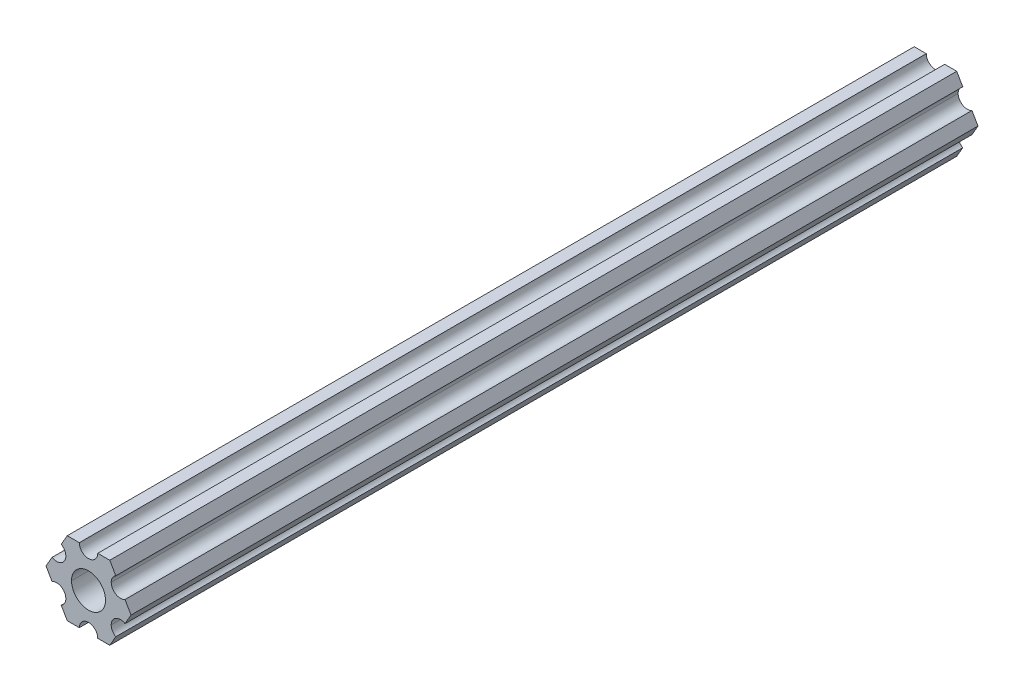
ISO-10303-21;
HEADER;
FILE_DESCRIPTION(('STEP AP214'),'2;1');
FILE_NAME('part.step','',(''),(''),'','','');
FILE_SCHEMA(('AUTOMOTIVE_DESIGN { 1 0 10303 214 1 1 1 1 }'));
ENDSEC;
DATA;
#1=APPLICATION_CONTEXT('core data for automotive mechanical design processes');
#2=APPLICATION_PROTOCOL_DEFINITION('international standard','automotive_design',2000,#1);
#3=PRODUCT_CONTEXT('',#1,'mechanical');
#4=PRODUCT('Part','Part','',(#3));
#5=PRODUCT_RELATED_PRODUCT_CATEGORY('part','',(#4));
#6=PRODUCT_DEFINITION_FORMATION('','',#4);
#7=PRODUCT_DEFINITION_CONTEXT('part definition',#1,'design');
#8=PRODUCT_DEFINITION('design','',#6,#7);
#9=PRODUCT_DEFINITION_SHAPE('','',#8);
#10=(LENGTH_UNIT() NAMED_UNIT(*) SI_UNIT(.MILLI.,.METRE.));
#11=(NAMED_UNIT(*) PLANE_ANGLE_UNIT() SI_UNIT($,.RADIAN.));
#12=(NAMED_UNIT(*) SI_UNIT($,.STERADIAN.) SOLID_ANGLE_UNIT());
#13=UNCERTAINTY_MEASURE_WITH_UNIT(LENGTH_MEASURE(1.E-05),#10,'distance_accuracy_value','');
#14=(GEOMETRIC_REPRESENTATION_CONTEXT(3) GLOBAL_UNCERTAINTY_ASSIGNED_CONTEXT((#13)) GLOBAL_UNIT_ASSIGNED_CONTEXT((#10,
#11,#12)) REPRESENTATION_CONTEXT('',''));
#15=CARTESIAN_POINT('',(0.,0.,0.));
#16=DIRECTION('',(0.,0.,1.));
#17=DIRECTION('',(1.,0.,0.));
#18=AXIS2_PLACEMENT_3D('',#15,#16,#17);
#19=CARTESIAN_POINT('',(0.,0.,304.8));
#20=DIRECTION('',(0.,0.,-1.));
#21=DIRECTION('',(-1.,0.,0.));
#22=AXIS2_PLACEMENT_3D('',#19,#20,#21);
#23=CYLINDRICAL_SURFACE('',#22,2.9337);
#24=DIRECTION('',(0.,0.,-1.));
#25=VECTOR('',#24,1.);
#26=CARTESIAN_POINT('',(2.9337,0.,304.8));
#27=LINE('',#26,#25);
#28=CARTESIAN_POINT('',(2.9337,0.,304.8));
#29=VERTEX_POINT('',#28);
#30=CARTESIAN_POINT('',(2.9337,0.,158.75));
#31=VERTEX_POINT('',#30);
#32=EDGE_CURVE('E250',#29,#31,#27,.T.);
#33=ORIENTED_EDGE('',*,*,#32,.T.);
#34=CARTESIAN_POINT('',(0.,0.,158.75));
#35=DIRECTION('',(0.,0.,1.));
#36=DIRECTION('',(1.,0.,0.));
#37=AXIS2_PLACEMENT_3D('',#34,#35,#36);
#38=CIRCLE('',#37,2.9337);
#39=CARTESIAN_POINT('',(-2.9337,0.,158.75));
#40=VERTEX_POINT('',#39);
#41=EDGE_CURVE('E66',#31,#40,#38,.F.);
#42=ORIENTED_EDGE('',*,*,#41,.T.);
#43=DIRECTION('',(0.,0.,-1.));
#44=VECTOR('',#43,1.);
#45=CARTESIAN_POINT('',(-2.9337,0.,304.8));
#46=LINE('',#45,#44);
#47=CARTESIAN_POINT('',(-2.9337,0.,304.8));
#48=VERTEX_POINT('',#47);
#49=EDGE_CURVE('E400',#48,#40,#46,.T.);
#50=ORIENTED_EDGE('',*,*,#49,.F.);
#51=CARTESIAN_POINT('',(0.,0.,304.8));
#52=DIRECTION('',(0.,0.,1.));
#53=DIRECTION('',(1.,0.,0.));
#54=AXIS2_PLACEMENT_3D('',#51,#52,#53);
#55=CIRCLE('',#54,2.9337);
#56=EDGE_CURVE('E52',#48,#29,#55,.T.);
#57=ORIENTED_EDGE('',*,*,#56,.T.);
#58=EDGE_LOOP('',(#33,#42,#50,#57));
#59=FACE_BOUND('',#58,.T.);
#60=ADVANCED_FACE('F44',(#59),#23,.F.);
#61=CARTESIAN_POINT('',(5.49926150638082,-3.17499966684067,304.8));
#62=DIRECTION('',(0.,0.,-1.));
#63=DIRECTION('',(-1.,0.,0.));
#64=AXIS2_PLACEMENT_3D('',#61,#62,#63);
#65=CYLINDRICAL_SURFACE('',#64,1.5875);
#66=DIRECTION('',(0.,0.,-1.));
#67=VECTOR('',#66,1.);
#68=CARTESIAN_POINT('',(3.91176150638082,-3.17499966684067,304.8));
#69=LINE('',#68,#67);
#70=CARTESIAN_POINT('',(3.91176150638082,-3.17499966684067,304.8));
#71=VERTEX_POINT('',#70);
#72=CARTESIAN_POINT('',(3.91176150638082,-3.17499966684067,158.75));
#73=VERTEX_POINT('',#72);
#74=EDGE_CURVE('E253',#71,#73,#69,.T.);
#75=ORIENTED_EDGE('',*,*,#74,.T.);
#76=CARTESIAN_POINT('',(5.49926150638082,-3.17499966684067,158.75));
#77=DIRECTION('',(0.,0.,1.));
#78=DIRECTION('',(1.,0.,0.));
#79=AXIS2_PLACEMENT_3D('',#76,#77,#78);
#80=CIRCLE('',#79,1.5875);
#81=CARTESIAN_POINT('',(6.29301142309098,-1.80018429024546,158.75));
#82=VERTEX_POINT('',#81);
#83=EDGE_CURVE('E59',#73,#82,#80,.F.);
#84=ORIENTED_EDGE('',*,*,#83,.T.);
#85=DIRECTION('',(0.,0.,-1.));
#86=VECTOR('',#85,1.);
#87=CARTESIAN_POINT('',(6.29301142309098,-1.80018429024546,304.8));
#88=LINE('',#87,#86);
#89=CARTESIAN_POINT('',(6.29301142309098,-1.80018429024546,304.8));
#90=VERTEX_POINT('',#89);
#91=EDGE_CURVE('E289',#90,#82,#88,.T.);
#92=ORIENTED_EDGE('',*,*,#91,.F.);
#93=CARTESIAN_POINT('',(5.49926150638082,-3.17499966684067,304.8));
#94=DIRECTION('',(0.,0.,-1.));
#95=DIRECTION('',(1.,0.,0.));
#96=AXIS2_PLACEMENT_3D('',#93,#94,#95);
#97=CIRCLE('',#96,1.5875);
#98=EDGE_CURVE('E276',#71,#90,#97,.T.);
#99=ORIENTED_EDGE('',*,*,#98,.F.);
#100=EDGE_LOOP('',(#75,#84,#92,#99));
#101=FACE_BOUND('',#100,.T.);
#102=ADVANCED_FACE('F492',(#101),#65,.F.);
#103=CARTESIAN_POINT('',(5.49926112168156,3.17500033315934,304.8));
#104=DIRECTION('',(0.,0.,-1.));
#105=DIRECTION('',(-1.,0.,0.));
#106=AXIS2_PLACEMENT_3D('',#103,#104,#105);
#107=CYLINDRICAL_SURFACE('',#106,1.5875);
#108=DIRECTION('',(0.,0.,-1.));
#109=VECTOR('',#108,1.);
#110=CARTESIAN_POINT('',(3.91176112168156,3.17500033315934,304.8));
#111=LINE('',#110,#109);
#112=CARTESIAN_POINT('',(3.91176112168156,3.17500033315934,304.8));
#113=VERTEX_POINT('',#112);
#114=CARTESIAN_POINT('',(3.91176112168156,3.17500033315934,158.75));
#115=VERTEX_POINT('',#114);
#116=EDGE_CURVE('E340',#113,#115,#111,.T.);
#117=ORIENTED_EDGE('',*,*,#116,.T.);
#118=CARTESIAN_POINT('',(5.49926112168156,3.17500033315934,158.75));
#119=DIRECTION('',(0.,0.,1.));
#120=DIRECTION('',(1.,0.,0.));
#121=AXIS2_PLACEMENT_3D('',#118,#119,#120);
#122=CIRCLE('',#121,1.5875);
#123=CARTESIAN_POINT('',(4.70551103839172,4.54981561357972,158.75));
#124=VERTEX_POINT('',#123);
#125=EDGE_CURVE('E452',#115,#124,#122,.F.);
#126=ORIENTED_EDGE('',*,*,#125,.T.);
#127=DIRECTION('',(0.,0.,-1.));
#128=VECTOR('',#127,1.);
#129=CARTESIAN_POINT('',(4.70551103839172,4.54981561357972,304.8));
#130=LINE('',#129,#128);
#131=CARTESIAN_POINT('',(4.70551103839172,4.54981561357972,304.8));
#132=VERTEX_POINT('',#131);
#133=EDGE_CURVE('E271',#132,#124,#130,.T.);
#134=ORIENTED_EDGE('',*,*,#133,.F.);
#135=CARTESIAN_POINT('',(5.49926112168156,3.17500033315934,304.8));
#136=DIRECTION('',(0.,0.,-1.));
#137=DIRECTION('',(1.,0.,0.));
#138=AXIS2_PLACEMENT_3D('',#135,#136,#137);
#139=CIRCLE('',#138,1.5875);
#140=EDGE_CURVE('E295',#113,#132,#139,.T.);
#141=ORIENTED_EDGE('',*,*,#140,.F.);
#142=EDGE_LOOP('',(#117,#126,#134,#141));
#143=FACE_BOUND('',#142,.T.);
#144=ADVANCED_FACE('F486',(#143),#107,.F.);
#145=CARTESIAN_POINT('',(5.49926112168156,3.17500033315934,304.8));
#146=DIRECTION('',(0.,0.,1.));
#147=DIRECTION('',(1.,0.,0.));
#148=AXIS2_PLACEMENT_3D('',#145,#146,#147);
#149=PLANE('',#148);
#150=DIRECTION('',(0.499999947533953,0.866025434075723,0.));
#151=VECTOR('',#150,1.);
#152=CARTESIAN_POINT('',(6.29301142309098,-1.80018429024546,304.8));
#153=LINE('',#152,#151);
#154=CARTESIAN_POINT('',(7.33234841870827,4.44212519169686E-07,304.8));
#155=VERTEX_POINT('',#154);
#156=EDGE_CURVE('E348',#90,#155,#153,.T.);
#157=ORIENTED_EDGE('',*,*,#156,.T.);
#158=DIRECTION('',(-0.500000052466056,0.866025373493145,0.));
#159=VECTOR('',#158,1.);
#160=CARTESIAN_POINT('',(7.33234841870827,4.44212519169686E-07,304.8));
#161=LINE('',#160,#159);
#162=CARTESIAN_POINT('',(6.29301120497139,1.80018505273894,304.8));
#163=VERTEX_POINT('',#162);
#164=EDGE_CURVE('E294',#155,#163,#161,.T.);
#165=ORIENTED_EDGE('',*,*,#164,.T.);
#166=CARTESIAN_POINT('',(5.49926112168156,3.17500033315934,304.8));
#167=DIRECTION('',(0.,0.,-1.));
#168=DIRECTION('',(1.,0.,0.));
#169=AXIS2_PLACEMENT_3D('',#166,#167,#168);
#170=CIRCLE('',#169,1.5875);
#171=EDGE_CURVE('E290',#163,#113,#170,.T.);
#172=ORIENTED_EDGE('',*,*,#171,.T.);
#173=ORIENTED_EDGE('',*,*,#140,.T.);
#174=DIRECTION('',(-0.500000052466046,0.866025373493151,0.));
#175=VECTOR('',#174,1.);
#176=CARTESIAN_POINT('',(4.70551103839172,4.54981561357972,304.8));
#177=LINE('',#176,#175);
#178=CARTESIAN_POINT('',(3.66617382465481,6.35000022210627,304.8));
#179=VERTEX_POINT('',#178);
#180=EDGE_CURVE('E355',#132,#179,#177,.T.);
#181=ORIENTED_EDGE('',*,*,#180,.T.);
#182=DIRECTION('',(-1.,-6.05825850611185E-08,0.));
#183=VECTOR('',#182,1.);
#184=CARTESIAN_POINT('',(3.66617382465481,6.35000022210627,304.8));
#185=LINE('',#184,#183);
#186=CARTESIAN_POINT('',(1.58749961530074,6.35000009617482,304.8));
#187=VERTEX_POINT('',#186);
#188=EDGE_CURVE('E361',#179,#187,#185,.T.);
#189=ORIENTED_EDGE('',*,*,#188,.T.);
#190=CARTESIAN_POINT('',(-3.84699260060323E-07,6.35,304.8));
#191=DIRECTION('',(0.,0.,-1.));
#192=DIRECTION('',(1.,0.,0.));
#193=AXIS2_PLACEMENT_3D('',#190,#191,#192);
#194=CIRCLE('',#193,1.5875);
#195=CARTESIAN_POINT('',(-1.58750038469926,6.34999990382519,304.8));
#196=VERTEX_POINT('',#195);
#197=EDGE_CURVE('E369',#187,#196,#194,.T.);
#198=ORIENTED_EDGE('',*,*,#197,.T.);
#199=DIRECTION('',(-1.,-6.05825963273174E-08,0.));
#200=VECTOR('',#199,1.);
#201=CARTESIAN_POINT('',(-1.58750038469926,6.34999990382518,304.8));
#202=LINE('',#201,#200);
#203=CARTESIAN_POINT('',(-3.66617459405349,6.3499997778937,304.8));
#204=VERTEX_POINT('',#203);
#205=EDGE_CURVE('E381',#196,#204,#202,.T.);
#206=ORIENTED_EDGE('',*,*,#205,.T.);
#207=DIRECTION('',(-0.499999947533943,-0.866025434075729,0.));
#208=VECTOR('',#207,1.);
#209=CARTESIAN_POINT('',(-3.66617459405349,6.3499997778937,304.8));
#210=LINE('',#209,#208);
#211=CARTESIAN_POINT('',(-4.70551158967065,4.54981504343587,304.8));
#212=VERTEX_POINT('',#211);
#213=EDGE_CURVE('E235',#204,#212,#210,.T.);
#214=ORIENTED_EDGE('',*,*,#213,.T.);
#215=CARTESIAN_POINT('',(-5.49926150638082,3.17499966684067,304.8));
#216=DIRECTION('',(0.,0.,-1.));
#217=DIRECTION('',(1.,0.,0.));
#218=AXIS2_PLACEMENT_3D('',#215,#216,#217);
#219=CIRCLE('',#218,1.5875);
#220=CARTESIAN_POINT('',(-6.29301142309098,1.80018429024547,304.8));
#221=VERTEX_POINT('',#220);
#222=EDGE_CURVE('E264',#212,#221,#219,.T.);
#223=ORIENTED_EDGE('',*,*,#222,.T.);
#224=DIRECTION('',(-0.499999947533951,-0.866025434075724,0.));
#225=VECTOR('',#224,1.);
#226=CARTESIAN_POINT('',(-6.29301142309098,1.80018429024547,304.8));
#227=LINE('',#226,#225);
#228=CARTESIAN_POINT('',(-7.33234841870827,-4.44212523790841E-07,304.8));
#229=VERTEX_POINT('',#228);
#230=EDGE_CURVE('E260',#221,#229,#227,.T.);
#231=ORIENTED_EDGE('',*,*,#230,.T.);
#232=DIRECTION('',(0.500000052466045,-0.866025373493151,0.));
#233=VECTOR('',#232,1.);
#234=CARTESIAN_POINT('',(-7.33234841870827,-4.44212523790841E-07,304.8));
#235=LINE('',#234,#233);
#236=CARTESIAN_POINT('',(-6.29301120497141,-1.80018505273897,304.8));
#237=VERTEX_POINT('',#236);
#238=EDGE_CURVE('E265',#229,#237,#235,.T.);
#239=ORIENTED_EDGE('',*,*,#238,.T.);
#240=CARTESIAN_POINT('',(-5.49926112168156,-3.17500033315934,304.8));
#241=DIRECTION('',(0.,0.,-1.));
#242=DIRECTION('',(1.,0.,0.));
#243=AXIS2_PLACEMENT_3D('',#240,#241,#242);
#244=CIRCLE('',#243,1.5875);
#245=CARTESIAN_POINT('',(-4.70551103839172,-4.54981561357972,304.8));
#246=VERTEX_POINT('',#245);
#247=EDGE_CURVE('E280',#237,#246,#244,.T.);
#248=ORIENTED_EDGE('',*,*,#247,.T.);
#249=DIRECTION('',(0.500000052466045,-0.866025373493152,0.));
#250=VECTOR('',#249,1.);
#251=CARTESIAN_POINT('',(-4.70551103839172,-4.54981561357972,304.8));
#252=LINE('',#251,#250);
#253=CARTESIAN_POINT('',(-3.66617382465481,-6.35000022210628,304.8));
#254=VERTEX_POINT('',#253);
#255=EDGE_CURVE('E336',#246,#254,#252,.T.);
#256=ORIENTED_EDGE('',*,*,#255,.T.);
#257=DIRECTION('',(1.,6.05825854783851E-08,0.));
#258=VECTOR('',#257,1.);
#259=CARTESIAN_POINT('',(-3.66617382465481,-6.35000022210628,304.8));
#260=LINE('',#259,#258);
#261=CARTESIAN_POINT('',(-1.58749961530073,-6.35000009617482,304.8));
#262=VERTEX_POINT('',#261);
#263=EDGE_CURVE('E341',#254,#262,#260,.T.);
#264=ORIENTED_EDGE('',*,*,#263,.T.);
#265=CARTESIAN_POINT('',(3.8469926204343E-07,-6.35,304.8));
#266=DIRECTION('',(0.,0.,-1.));
#267=DIRECTION('',(1.,0.,0.));
#268=AXIS2_PLACEMENT_3D('',#265,#266,#267);
#269=CIRCLE('',#268,1.5875);
#270=CARTESIAN_POINT('',(1.58750038469926,-6.34999990382518,304.8));
#271=VERTEX_POINT('',#270);
#272=EDGE_CURVE('E258',#262,#271,#269,.T.);
#273=ORIENTED_EDGE('',*,*,#272,.T.);
#274=DIRECTION('',(1.,6.05825721258438E-08,0.));
#275=VECTOR('',#274,1.);
#276=CARTESIAN_POINT('',(1.58750038469926,-6.34999990382518,304.8));
#277=LINE('',#276,#275);
#278=CARTESIAN_POINT('',(3.66617459405346,-6.34999977789375,304.8));
#279=VERTEX_POINT('',#278);
#280=EDGE_CURVE('E254',#271,#279,#277,.T.);
#281=ORIENTED_EDGE('',*,*,#280,.T.);
#282=DIRECTION('',(0.499999947533941,0.86602543407573,0.));
#283=VECTOR('',#282,1.);
#284=CARTESIAN_POINT('',(3.66617459405346,-6.34999977789375,304.8));
#285=LINE('',#284,#283);
#286=CARTESIAN_POINT('',(4.70551158967065,-4.54981504343587,304.8));
#287=VERTEX_POINT('',#286);
#288=EDGE_CURVE('E259',#279,#287,#285,.T.);
#289=ORIENTED_EDGE('',*,*,#288,.T.);
#290=CARTESIAN_POINT('',(5.49926150638082,-3.17499966684067,304.8));
#291=DIRECTION('',(0.,0.,-1.));
#292=DIRECTION('',(1.,0.,0.));
#293=AXIS2_PLACEMENT_3D('',#290,#291,#292);
#294=CIRCLE('',#293,1.5875);
#295=EDGE_CURVE('E272',#287,#71,#294,.T.);
#296=ORIENTED_EDGE('',*,*,#295,.T.);
#297=ORIENTED_EDGE('',*,*,#98,.T.);
#298=EDGE_LOOP('',(#157,#165,#172,#173,#181,#189,#198,#206,#214,#223,#231,#239,#248,#256,#264,
#273,#281,#289,#296,#297));
#299=FACE_BOUND('',#298,.T.);
#300=ORIENTED_EDGE('',*,*,#56,.F.);
#301=CARTESIAN_POINT('',(0.,0.,304.8));
#302=DIRECTION('',(0.,0.,1.));
#303=DIRECTION('',(1.,0.,0.));
#304=AXIS2_PLACEMENT_3D('',#301,#302,#303);
#305=CIRCLE('',#304,2.9337);
#306=EDGE_CURVE('E396',#29,#48,#305,.T.);
#307=ORIENTED_EDGE('',*,*,#306,.F.);
#308=EDGE_LOOP('',(#300,#307));
#309=FACE_BOUND('',#308,.T.);
#310=ADVANCED_FACE('F471',(#299,#309),#149,.T.);
#311=CARTESIAN_POINT('',(6.29301142309098,-1.80018429024546,304.8));
#312=DIRECTION('',(-0.866025434075723,0.499999947533953,0.));
#313=DIRECTION('',(0.,0.,1.));
#314=AXIS2_PLACEMENT_3D('',#311,#312,#313);
#315=PLANE('',#314);
#316=ORIENTED_EDGE('',*,*,#91,.T.);
#317=DIRECTION('',(0.499999947533953,0.866025434075723,0.));
#318=VECTOR('',#317,1.);
#319=CARTESIAN_POINT('',(6.29301142309098,-1.80018429024546,158.75));
#320=LINE('',#319,#318);
#321=CARTESIAN_POINT('',(7.33234841870827,4.44212509336798E-07,158.75));
#322=VERTEX_POINT('',#321);
#323=EDGE_CURVE('E445',#82,#322,#320,.T.);
#324=ORIENTED_EDGE('',*,*,#323,.T.);
#325=DIRECTION('',(0.,0.,-1.));
#326=VECTOR('',#325,1.);
#327=CARTESIAN_POINT('',(7.33234841870827,4.44212519169686E-07,304.8));
#328=LINE('',#327,#326);
#329=EDGE_CURVE('E270',#155,#322,#328,.T.);
#330=ORIENTED_EDGE('',*,*,#329,.F.);
#331=ORIENTED_EDGE('',*,*,#156,.F.);
#332=EDGE_LOOP('',(#316,#324,#330,#331));
#333=FACE_BOUND('',#332,.T.);
#334=ADVANCED_FACE('F485',(#333),#315,.F.);
#335=CARTESIAN_POINT('',(7.33234841870827,4.44212519169686E-07,304.8));
#336=DIRECTION('',(-0.866025373493145,-0.500000052466057,0.));
#337=DIRECTION('',(-0.500000052466057,0.866025373493145,0.));
#338=AXIS2_PLACEMENT_3D('',#335,#336,#337);
#339=PLANE('',#338);
#340=ORIENTED_EDGE('',*,*,#329,.T.);
#341=DIRECTION('',(-0.500000052466057,0.866025373493145,0.));
#342=VECTOR('',#341,1.);
#343=CARTESIAN_POINT('',(7.33234841870827,4.44212519169686E-07,158.75));
#344=LINE('',#343,#342);
#345=CARTESIAN_POINT('',(6.2930112049714,1.80018505273894,158.75));
#346=VERTEX_POINT('',#345);
#347=EDGE_CURVE('E447',#322,#346,#344,.T.);
#348=ORIENTED_EDGE('',*,*,#347,.T.);
#349=DIRECTION('',(0.,0.,-1.));
#350=VECTOR('',#349,1.);
#351=CARTESIAN_POINT('',(6.29301120497139,1.80018505273894,304.8));
#352=LINE('',#351,#350);
#353=EDGE_CURVE('E266',#163,#346,#352,.T.);
#354=ORIENTED_EDGE('',*,*,#353,.F.);
#355=ORIENTED_EDGE('',*,*,#164,.F.);
#356=EDGE_LOOP('',(#340,#348,#354,#355));
#357=FACE_BOUND('',#356,.T.);
#358=ADVANCED_FACE('F46',(#357),#339,.F.);
#359=CARTESIAN_POINT('',(5.49926112168156,3.17500033315934,304.8));
#360=DIRECTION('',(0.,0.,-1.));
#361=DIRECTION('',(-1.,0.,0.));
#362=AXIS2_PLACEMENT_3D('',#359,#360,#361);
#363=CYLINDRICAL_SURFACE('',#362,1.5875);
#364=ORIENTED_EDGE('',*,*,#353,.T.);
#365=CARTESIAN_POINT('',(5.49926112168156,3.17500033315934,158.75));
#366=DIRECTION('',(0.,0.,1.));
#367=DIRECTION('',(1.,0.,0.));
#368=AXIS2_PLACEMENT_3D('',#365,#366,#367);
#369=CIRCLE('',#368,1.5875);
#370=EDGE_CURVE('E449',#346,#115,#369,.F.);
#371=ORIENTED_EDGE('',*,*,#370,.T.);
#372=ORIENTED_EDGE('',*,*,#116,.F.);
#373=ORIENTED_EDGE('',*,*,#171,.F.);
#374=EDGE_LOOP('',(#364,#371,#372,#373));
#375=FACE_BOUND('',#374,.T.);
#376=ADVANCED_FACE('F509',(#375),#363,.F.);
#377=CARTESIAN_POINT('',(4.70551103839172,4.54981561357972,304.8));
#378=DIRECTION('',(-0.866025373493151,-0.500000052466046,0.));
#379=DIRECTION('',(-0.500000052466046,0.866025373493151,0.));
#380=AXIS2_PLACEMENT_3D('',#377,#378,#379);
#381=PLANE('',#380);
#382=ORIENTED_EDGE('',*,*,#133,.T.);
#383=DIRECTION('',(-0.500000052466046,0.866025373493151,0.));
#384=VECTOR('',#383,1.);
#385=CARTESIAN_POINT('',(4.70551103839172,4.54981561357972,158.75));
#386=LINE('',#385,#384);
#387=CARTESIAN_POINT('',(3.66617382465481,6.3500002221064,158.75));
#388=VERTEX_POINT('',#387);
#389=EDGE_CURVE('E455',#124,#388,#386,.T.);
#390=ORIENTED_EDGE('',*,*,#389,.T.);
#391=DIRECTION('',(0.,0.,-1.));
#392=VECTOR('',#391,1.);
#393=CARTESIAN_POINT('',(3.66617382465481,6.35000022210627,304.8));
#394=LINE('',#393,#392);
#395=EDGE_CURVE('E299',#179,#388,#394,.T.);
#396=ORIENTED_EDGE('',*,*,#395,.F.);
#397=ORIENTED_EDGE('',*,*,#180,.F.);
#398=EDGE_LOOP('',(#382,#390,#396,#397));
#399=FACE_BOUND('',#398,.T.);
#400=ADVANCED_FACE('F512',(#399),#381,.F.);
#401=CARTESIAN_POINT('',(3.66617382465481,6.35000022210627,304.8));
#402=DIRECTION('',(6.05825850611185E-08,-1.,0.));
#403=DIRECTION('',(0.,0.,-1.));
#404=AXIS2_PLACEMENT_3D('',#401,#402,#403);
#405=PLANE('',#404);
#406=ORIENTED_EDGE('',*,*,#395,.T.);
#407=DIRECTION('',(0.999999999999998,6.05825963288247E-08,0.));
#408=VECTOR('',#407,1.);
#409=CARTESIAN_POINT('',(-3.84699486688041E-07,6.35000000000005,158.75));
#410=LINE('',#409,#408);
#411=CARTESIAN_POINT('',(1.58749961530074,6.35000009617492,158.75));
#412=VERTEX_POINT('',#411);
#413=EDGE_CURVE('E231',#412,#388,#410,.T.);
#414=ORIENTED_EDGE('',*,*,#413,.F.);
#415=DIRECTION('',(0.,0.,-1.));
#416=VECTOR('',#415,1.);
#417=CARTESIAN_POINT('',(1.58749961530074,6.35000009617482,304.8));
#418=LINE('',#417,#416);
#419=EDGE_CURVE('E243',#187,#412,#418,.T.);
#420=ORIENTED_EDGE('',*,*,#419,.F.);
#421=ORIENTED_EDGE('',*,*,#188,.F.);
#422=EDGE_LOOP('',(#406,#414,#420,#421));
#423=FACE_BOUND('',#422,.T.);
#424=ADVANCED_FACE('F478',(#423),#405,.F.);
#425=CARTESIAN_POINT('',(-3.84699260060323E-07,6.35,304.8));
#426=DIRECTION('',(0.,0.,-1.));
#427=DIRECTION('',(-1.,0.,0.));
#428=AXIS2_PLACEMENT_3D('',#425,#426,#427);
#429=CYLINDRICAL_SURFACE('',#428,1.5875);
#430=ORIENTED_EDGE('',*,*,#419,.T.);
#431=CARTESIAN_POINT('',(-3.84699260060323E-07,6.35,158.75));
#432=DIRECTION('',(0.,0.,1.));
#433=DIRECTION('',(1.,0.,0.));
#434=AXIS2_PLACEMENT_3D('',#431,#432,#433);
#435=CIRCLE('',#434,1.5875);
#436=CARTESIAN_POINT('',(-1.58750038469926,6.34999990382518,158.75));
#437=VERTEX_POINT('',#436);
#438=EDGE_CURVE('E404',#412,#437,#435,.F.);
#439=ORIENTED_EDGE('',*,*,#438,.T.);
#440=DIRECTION('',(0.,0.,-1.));
#441=VECTOR('',#440,1.);
#442=CARTESIAN_POINT('',(-1.58750038469926,6.34999990382519,304.8));
#443=LINE('',#442,#441);
#444=EDGE_CURVE('E230',#196,#437,#443,.T.);
#445=ORIENTED_EDGE('',*,*,#444,.F.);
#446=ORIENTED_EDGE('',*,*,#197,.F.);
#447=EDGE_LOOP('',(#430,#439,#445,#446));
#448=FACE_BOUND('',#447,.T.);
#449=ADVANCED_FACE('F475',(#448),#429,.F.);
#450=CARTESIAN_POINT('',(-1.58750038469926,6.34999990382518,304.8));
#451=DIRECTION('',(6.05825963273174E-08,-1.,0.));
#452=DIRECTION('',(0.,0.,-1.));
#453=AXIS2_PLACEMENT_3D('',#450,#451,#452);
#454=PLANE('',#453);
#455=ORIENTED_EDGE('',*,*,#444,.T.);
#456=CARTESIAN_POINT('',(-3.66617459405349,6.3499997778937,158.75));
#457=VERTEX_POINT('',#456);
#458=EDGE_CURVE('E215',#457,#437,#410,.T.);
#459=ORIENTED_EDGE('',*,*,#458,.F.);
#460=DIRECTION('',(0.,0.,-1.));
#461=VECTOR('',#460,1.);
#462=CARTESIAN_POINT('',(-3.66617459405349,6.3499997778937,304.8));
#463=LINE('',#462,#461);
#464=EDGE_CURVE('E228',#204,#457,#463,.T.);
#465=ORIENTED_EDGE('',*,*,#464,.F.);
#466=ORIENTED_EDGE('',*,*,#205,.F.);
#467=EDGE_LOOP('',(#455,#459,#465,#466));
#468=FACE_BOUND('',#467,.T.);
#469=ADVANCED_FACE('F227',(#468),#454,.F.);
#470=CARTESIAN_POINT('',(-3.66617459405349,6.3499997778937,304.8));
#471=DIRECTION('',(0.866025434075729,-0.499999947533942,0.));
#472=DIRECTION('',(0.,0.,-1.));
#473=AXIS2_PLACEMENT_3D('',#470,#471,#472);
#474=PLANE('',#473);
#475=ORIENTED_EDGE('',*,*,#464,.T.);
#476=DIRECTION('',(-0.499999947533942,-0.866025434075729,0.));
#477=VECTOR('',#476,1.);
#478=CARTESIAN_POINT('',(-3.66617459405349,6.3499997778937,158.75));
#479=LINE('',#478,#477);
#480=CARTESIAN_POINT('',(-4.70551158967065,4.54981504343587,158.75));
#481=VERTEX_POINT('',#480);
#482=EDGE_CURVE('E212',#457,#481,#479,.T.);
#483=ORIENTED_EDGE('',*,*,#482,.T.);
#484=DIRECTION('',(0.,0.,-1.));
#485=VECTOR('',#484,1.);
#486=CARTESIAN_POINT('',(-4.70551158967065,4.54981504343587,304.8));
#487=LINE('',#486,#485);
#488=EDGE_CURVE('E238',#212,#481,#487,.T.);
#489=ORIENTED_EDGE('',*,*,#488,.F.);
#490=ORIENTED_EDGE('',*,*,#213,.F.);
#491=EDGE_LOOP('',(#475,#483,#489,#490));
#492=FACE_BOUND('',#491,.T.);
#493=ADVANCED_FACE('F233',(#492),#474,.F.);
#494=CARTESIAN_POINT('',(-5.49926150638082,3.17499966684067,304.8));
#495=DIRECTION('',(0.,0.,-1.));
#496=DIRECTION('',(-1.,0.,0.));
#497=AXIS2_PLACEMENT_3D('',#494,#495,#496);
#498=CYLINDRICAL_SURFACE('',#497,1.5875);
#499=ORIENTED_EDGE('',*,*,#488,.T.);
#500=CARTESIAN_POINT('',(-5.49926150638082,3.17499966684067,158.75));
#501=DIRECTION('',(0.,0.,1.));
#502=DIRECTION('',(1.,0.,0.));
#503=AXIS2_PLACEMENT_3D('',#500,#501,#502);
#504=CIRCLE('',#503,1.5875);
#505=CARTESIAN_POINT('',(-6.29301142309098,1.80018429024547,158.75));
#506=VERTEX_POINT('',#505);
#507=EDGE_CURVE('E218',#481,#506,#504,.F.);
#508=ORIENTED_EDGE('',*,*,#507,.T.);
#509=DIRECTION('',(0.,0.,-1.));
#510=VECTOR('',#509,1.);
#511=CARTESIAN_POINT('',(-6.29301142309098,1.80018429024547,304.8));
#512=LINE('',#511,#510);
#513=EDGE_CURVE('E246',#221,#506,#512,.T.);
#514=ORIENTED_EDGE('',*,*,#513,.F.);
#515=ORIENTED_EDGE('',*,*,#222,.F.);
#516=EDGE_LOOP('',(#499,#508,#514,#515));
#517=FACE_BOUND('',#516,.T.);
#518=ADVANCED_FACE('F537',(#517),#498,.F.);
#519=CARTESIAN_POINT('',(-6.29301142309098,1.80018429024547,304.8));
#520=DIRECTION('',(0.866025434075724,-0.499999947533952,0.));
#521=DIRECTION('',(0.,0.,-1.));
#522=AXIS2_PLACEMENT_3D('',#519,#520,#521);
#523=PLANE('',#522);
#524=ORIENTED_EDGE('',*,*,#513,.T.);
#525=DIRECTION('',(-0.499999947533952,-0.866025434075724,0.));
#526=VECTOR('',#525,1.);
#527=CARTESIAN_POINT('',(-6.29301142309098,1.80018429024547,158.75));
#528=LINE('',#527,#526);
#529=CARTESIAN_POINT('',(-7.33234841870827,-4.44212524403076E-07,158.75));
#530=VERTEX_POINT('',#529);
#531=EDGE_CURVE('E440',#506,#530,#528,.T.);
#532=ORIENTED_EDGE('',*,*,#531,.T.);
#533=DIRECTION('',(0.,0.,-1.));
#534=VECTOR('',#533,1.);
#535=CARTESIAN_POINT('',(-7.33234841870827,-4.44212523790841E-07,304.8));
#536=LINE('',#535,#534);
#537=EDGE_CURVE('E281',#229,#530,#536,.T.);
#538=ORIENTED_EDGE('',*,*,#537,.F.);
#539=ORIENTED_EDGE('',*,*,#230,.F.);
#540=EDGE_LOOP('',(#524,#532,#538,#539));
#541=FACE_BOUND('',#540,.T.);
#542=ADVANCED_FACE('F529',(#541),#523,.F.);
#543=CARTESIAN_POINT('',(-7.33234841870827,-4.44212523790841E-07,304.8));
#544=DIRECTION('',(0.866025373493151,0.500000052466045,0.));
#545=DIRECTION('',(0.,0.,-1.));
#546=AXIS2_PLACEMENT_3D('',#543,#544,#545);
#547=PLANE('',#546);
#548=ORIENTED_EDGE('',*,*,#537,.T.);
#549=DIRECTION('',(0.500000052466045,-0.866025373493151,0.));
#550=VECTOR('',#549,1.);
#551=CARTESIAN_POINT('',(-7.33234841870827,-4.44212523790841E-07,158.75));
#552=LINE('',#551,#550);
#553=CARTESIAN_POINT('',(-6.29301120497141,-1.80018505273896,158.75));
#554=VERTEX_POINT('',#553);
#555=EDGE_CURVE('E437',#530,#554,#552,.T.);
#556=ORIENTED_EDGE('',*,*,#555,.T.);
#557=DIRECTION('',(0.,0.,-1.));
#558=VECTOR('',#557,1.);
#559=CARTESIAN_POINT('',(-6.29301120497141,-1.80018505273897,304.8));
#560=LINE('',#559,#558);
#561=EDGE_CURVE('E285',#237,#554,#560,.T.);
#562=ORIENTED_EDGE('',*,*,#561,.F.);
#563=ORIENTED_EDGE('',*,*,#238,.F.);
#564=EDGE_LOOP('',(#548,#556,#562,#563));
#565=FACE_BOUND('',#564,.T.);
#566=ADVANCED_FACE('F525',(#565),#547,.F.);
#567=CARTESIAN_POINT('',(-5.49926112168156,-3.17500033315934,304.8));
#568=DIRECTION('',(0.,0.,-1.));
#569=DIRECTION('',(-1.,0.,0.));
#570=AXIS2_PLACEMENT_3D('',#567,#568,#569);
#571=CYLINDRICAL_SURFACE('',#570,1.5875);
#572=ORIENTED_EDGE('',*,*,#561,.T.);
#573=CARTESIAN_POINT('',(-5.49926112168156,-3.17500033315934,158.75));
#574=DIRECTION('',(0.,0.,1.));
#575=DIRECTION('',(1.,0.,0.));
#576=AXIS2_PLACEMENT_3D('',#573,#574,#575);
#577=CIRCLE('',#576,1.5875);
#578=CARTESIAN_POINT('',(-4.70551103839172,-4.54981561357972,158.75));
#579=VERTEX_POINT('',#578);
#580=EDGE_CURVE('E434',#554,#579,#577,.F.);
#581=ORIENTED_EDGE('',*,*,#580,.T.);
#582=DIRECTION('',(0.,0.,-1.));
#583=VECTOR('',#582,1.);
#584=CARTESIAN_POINT('',(-4.70551103839172,-4.54981561357972,304.8));
#585=LINE('',#584,#583);
#586=EDGE_CURVE('E306',#246,#579,#585,.T.);
#587=ORIENTED_EDGE('',*,*,#586,.F.);
#588=ORIENTED_EDGE('',*,*,#247,.F.);
#589=EDGE_LOOP('',(#572,#581,#587,#588));
#590=FACE_BOUND('',#589,.T.);
#591=ADVANCED_FACE('F528',(#590),#571,.F.);
#592=CARTESIAN_POINT('',(-4.70551103839172,-4.54981561357972,304.8));
#593=DIRECTION('',(0.866025373493152,0.500000052466045,0.));
#594=DIRECTION('',(0.,0.,-1.));
#595=AXIS2_PLACEMENT_3D('',#592,#593,#594);
#596=PLANE('',#595);
#597=ORIENTED_EDGE('',*,*,#586,.T.);
#598=DIRECTION('',(0.500000052466045,-0.866025373493152,0.));
#599=VECTOR('',#598,1.);
#600=CARTESIAN_POINT('',(-4.70551103839172,-4.54981561357972,158.75));
#601=LINE('',#600,#599);
#602=CARTESIAN_POINT('',(-3.66617382465481,-6.35000022210628,158.75));
#603=VERTEX_POINT('',#602);
#604=EDGE_CURVE('E431',#579,#603,#601,.T.);
#605=ORIENTED_EDGE('',*,*,#604,.T.);
#606=DIRECTION('',(0.,0.,-1.));
#607=VECTOR('',#606,1.);
#608=CARTESIAN_POINT('',(-3.66617382465481,-6.35000022210628,304.8));
#609=LINE('',#608,#607);
#610=EDGE_CURVE('E349',#254,#603,#609,.T.);
#611=ORIENTED_EDGE('',*,*,#610,.F.);
#612=ORIENTED_EDGE('',*,*,#255,.F.);
#613=EDGE_LOOP('',(#597,#605,#611,#612));
#614=FACE_BOUND('',#613,.T.);
#615=ADVANCED_FACE('F521',(#614),#596,.F.);
#616=CARTESIAN_POINT('',(-3.66617382465481,-6.35000022210628,304.8));
#617=DIRECTION('',(-6.05825854783851E-08,1.,0.));
#618=DIRECTION('',(0.,0.,1.));
#619=AXIS2_PLACEMENT_3D('',#616,#617,#618);
#620=PLANE('',#619);
#621=ORIENTED_EDGE('',*,*,#610,.T.);
#622=DIRECTION('',(0.999999999999998,6.0582585478385E-08,0.));
#623=VECTOR('',#622,1.);
#624=CARTESIAN_POINT('',(-3.66617382465481,-6.35000022210628,158.75));
#625=LINE('',#624,#623);
#626=CARTESIAN_POINT('',(-1.58749961530073,-6.35000009617482,158.75));
#627=VERTEX_POINT('',#626);
#628=EDGE_CURVE('E428',#603,#627,#625,.T.);
#629=ORIENTED_EDGE('',*,*,#628,.T.);
#630=DIRECTION('',(0.,0.,-1.));
#631=VECTOR('',#630,1.);
#632=CARTESIAN_POINT('',(-1.58749961530073,-6.35000009617482,304.8));
#633=LINE('',#632,#631);
#634=EDGE_CURVE('E352',#262,#627,#633,.T.);
#635=ORIENTED_EDGE('',*,*,#634,.F.);
#636=ORIENTED_EDGE('',*,*,#263,.F.);
#637=EDGE_LOOP('',(#621,#629,#635,#636));
#638=FACE_BOUND('',#637,.T.);
#639=ADVANCED_FACE('F517',(#638),#620,.F.);
#640=CARTESIAN_POINT('',(3.8469926204343E-07,-6.35,304.8));
#641=DIRECTION('',(0.,0.,-1.));
#642=DIRECTION('',(-1.,0.,0.));
#643=AXIS2_PLACEMENT_3D('',#640,#641,#642);
#644=CYLINDRICAL_SURFACE('',#643,1.5875);
#645=ORIENTED_EDGE('',*,*,#634,.T.);
#646=CARTESIAN_POINT('',(3.8469926204343E-07,-6.35,158.75));
#647=DIRECTION('',(0.,0.,1.));
#648=DIRECTION('',(1.,0.,0.));
#649=AXIS2_PLACEMENT_3D('',#646,#647,#648);
#650=CIRCLE('',#649,1.5875);
#651=CARTESIAN_POINT('',(1.58750038469926,-6.34999990382518,158.75));
#652=VERTEX_POINT('',#651);
#653=EDGE_CURVE('E421',#627,#652,#650,.F.);
#654=ORIENTED_EDGE('',*,*,#653,.T.);
#655=DIRECTION('',(0.,0.,-1.));
#656=VECTOR('',#655,1.);
#657=CARTESIAN_POINT('',(1.58750038469926,-6.34999990382518,304.8));
#658=LINE('',#657,#656);
#659=EDGE_CURVE('E311',#271,#652,#658,.T.);
#660=ORIENTED_EDGE('',*,*,#659,.F.);
#661=ORIENTED_EDGE('',*,*,#272,.F.);
#662=EDGE_LOOP('',(#645,#654,#660,#661));
#663=FACE_BOUND('',#662,.T.);
#664=ADVANCED_FACE('F520',(#663),#644,.F.);
#665=CARTESIAN_POINT('',(1.58750038469926,-6.34999990382518,304.8));
#666=DIRECTION('',(-6.05825721258438E-08,1.,0.));
#667=DIRECTION('',(0.,0.,1.));
#668=AXIS2_PLACEMENT_3D('',#665,#666,#667);
#669=PLANE('',#668);
#670=ORIENTED_EDGE('',*,*,#659,.T.);
#671=DIRECTION('',(0.999999999999998,6.05825721258437E-08,0.));
#672=VECTOR('',#671,1.);
#673=CARTESIAN_POINT('',(1.58750038469926,-6.34999990382518,158.75));
#674=LINE('',#673,#672);
#675=CARTESIAN_POINT('',(3.66617459405346,-6.34999977789375,158.75));
#676=VERTEX_POINT('',#675);
#677=EDGE_CURVE('E419',#652,#676,#674,.T.);
#678=ORIENTED_EDGE('',*,*,#677,.T.);
#679=DIRECTION('',(0.,0.,-1.));
#680=VECTOR('',#679,1.);
#681=CARTESIAN_POINT('',(3.66617459405346,-6.34999977789375,304.8));
#682=LINE('',#681,#680);
#683=EDGE_CURVE('E307',#279,#676,#682,.T.);
#684=ORIENTED_EDGE('',*,*,#683,.F.);
#685=ORIENTED_EDGE('',*,*,#280,.F.);
#686=EDGE_LOOP('',(#670,#678,#684,#685));
#687=FACE_BOUND('',#686,.T.);
#688=ADVANCED_FACE('F508',(#687),#669,.F.);
#689=CARTESIAN_POINT('',(3.66617459405346,-6.34999977789375,304.8));
#690=DIRECTION('',(-0.86602543407573,0.499999947533941,0.));
#691=DIRECTION('',(0.,0.,1.));
#692=AXIS2_PLACEMENT_3D('',#689,#690,#691);
#693=PLANE('',#692);
#694=ORIENTED_EDGE('',*,*,#683,.T.);
#695=DIRECTION('',(0.499999947533941,0.86602543407573,0.));
#696=VECTOR('',#695,1.);
#697=CARTESIAN_POINT('',(3.66617459405346,-6.34999977789375,158.75));
#698=LINE('',#697,#696);
#699=CARTESIAN_POINT('',(4.70551158967065,-4.54981504343587,158.75));
#700=VERTEX_POINT('',#699);
#701=EDGE_CURVE('E416',#676,#700,#698,.T.);
#702=ORIENTED_EDGE('',*,*,#701,.T.);
#703=DIRECTION('',(0.,0.,-1.));
#704=VECTOR('',#703,1.);
#705=CARTESIAN_POINT('',(4.70551158967065,-4.54981504343587,304.8));
#706=LINE('',#705,#704);
#707=EDGE_CURVE('E312',#287,#700,#706,.T.);
#708=ORIENTED_EDGE('',*,*,#707,.F.);
#709=ORIENTED_EDGE('',*,*,#288,.F.);
#710=EDGE_LOOP('',(#694,#702,#708,#709));
#711=FACE_BOUND('',#710,.T.);
#712=ADVANCED_FACE('F415',(#711),#693,.F.);
#713=CARTESIAN_POINT('',(5.49926150638082,-3.17499966684067,304.8));
#714=DIRECTION('',(0.,0.,-1.));
#715=DIRECTION('',(-1.,0.,0.));
#716=AXIS2_PLACEMENT_3D('',#713,#714,#715);
#717=CYLINDRICAL_SURFACE('',#716,1.5875);
#718=ORIENTED_EDGE('',*,*,#707,.T.);
#719=CARTESIAN_POINT('',(5.49926150638082,-3.17499966684067,158.75));
#720=DIRECTION('',(0.,0.,1.));
#721=DIRECTION('',(1.,0.,0.));
#722=AXIS2_PLACEMENT_3D('',#719,#720,#721);
#723=CIRCLE('',#722,1.5875);
#724=EDGE_CURVE('E412',#700,#73,#723,.F.);
#725=ORIENTED_EDGE('',*,*,#724,.T.);
#726=ORIENTED_EDGE('',*,*,#74,.F.);
#727=ORIENTED_EDGE('',*,*,#295,.F.);
#728=EDGE_LOOP('',(#718,#725,#726,#727));
#729=FACE_BOUND('',#728,.T.);
#730=ADVANCED_FACE('F410',(#729),#717,.F.);
#731=CARTESIAN_POINT('',(0.,0.,304.8));
#732=DIRECTION('',(0.,0.,-1.));
#733=DIRECTION('',(-1.,0.,0.));
#734=AXIS2_PLACEMENT_3D('',#731,#732,#733);
#735=CYLINDRICAL_SURFACE('',#734,2.9337);
#736=ORIENTED_EDGE('',*,*,#49,.T.);
#737=CARTESIAN_POINT('',(0.,0.,158.75));
#738=DIRECTION('',(0.,0.,1.));
#739=DIRECTION('',(1.,0.,0.));
#740=AXIS2_PLACEMENT_3D('',#737,#738,#739);
#741=CIRCLE('',#740,2.9337);
#742=EDGE_CURVE('E11',#40,#31,#741,.F.);
#743=ORIENTED_EDGE('',*,*,#742,.T.);
#744=ORIENTED_EDGE('',*,*,#32,.F.);
#745=ORIENTED_EDGE('',*,*,#306,.T.);
#746=EDGE_LOOP('',(#736,#743,#744,#745));
#747=FACE_BOUND('',#746,.T.);
#748=ADVANCED_FACE('F482',(#747),#735,.F.);
#749=CARTESIAN_POINT('',(5.38579281340275E-07,-8.88999999999992,158.75));
#750=DIRECTION('',(0.,0.,1.));
#751=DIRECTION('',(1.,0.,0.));
#752=AXIS2_PLACEMENT_3D('',#749,#750,#751);
#753=PLANE('',#752);
#754=ORIENTED_EDGE('',*,*,#742,.F.);
#755=ORIENTED_EDGE('',*,*,#41,.F.);
#756=EDGE_LOOP('',(#754,#755));
#757=FACE_BOUND('',#756,.T.);
#758=ORIENTED_EDGE('',*,*,#413,.T.);
#759=ORIENTED_EDGE('',*,*,#389,.F.);
#760=ORIENTED_EDGE('',*,*,#125,.F.);
#761=ORIENTED_EDGE('',*,*,#370,.F.);
#762=ORIENTED_EDGE('',*,*,#347,.F.);
#763=ORIENTED_EDGE('',*,*,#323,.F.);
#764=ORIENTED_EDGE('',*,*,#83,.F.);
#765=ORIENTED_EDGE('',*,*,#724,.F.);
#766=ORIENTED_EDGE('',*,*,#701,.F.);
#767=ORIENTED_EDGE('',*,*,#677,.F.);
#768=ORIENTED_EDGE('',*,*,#653,.F.);
#769=ORIENTED_EDGE('',*,*,#628,.F.);
#770=ORIENTED_EDGE('',*,*,#604,.F.);
#771=ORIENTED_EDGE('',*,*,#580,.F.);
#772=ORIENTED_EDGE('',*,*,#555,.F.);
#773=ORIENTED_EDGE('',*,*,#531,.F.);
#774=ORIENTED_EDGE('',*,*,#507,.F.);
#775=ORIENTED_EDGE('',*,*,#482,.F.);
#776=ORIENTED_EDGE('',*,*,#458,.T.);
#777=ORIENTED_EDGE('',*,*,#438,.F.);
#778=EDGE_LOOP('',(#758,#759,#760,#761,#762,#763,#764,#765,#766,#767,#768,#769,#770,#771,#772,
#773,#774,#775,#776,#777));
#779=FACE_BOUND('',#778,.T.);
#780=ADVANCED_FACE('F214',(#757,#779),#753,.F.);
#781=CLOSED_SHELL('',(#60,#102,#144,#310,#334,#358,#376,#400,#424,#449,#469,#493,#518,#542,#566,
#591,#615,#639,#664,#688,#712,#730,#748,#780));
#782=MANIFOLD_SOLID_BREP('B2',#781);
#783=ADVANCED_BREP_SHAPE_REPRESENTATION('',(#18,#782),#14);
#784=SHAPE_DEFINITION_REPRESENTATION(#9,#783);
ENDSEC;
END-ISO-10303-21;
